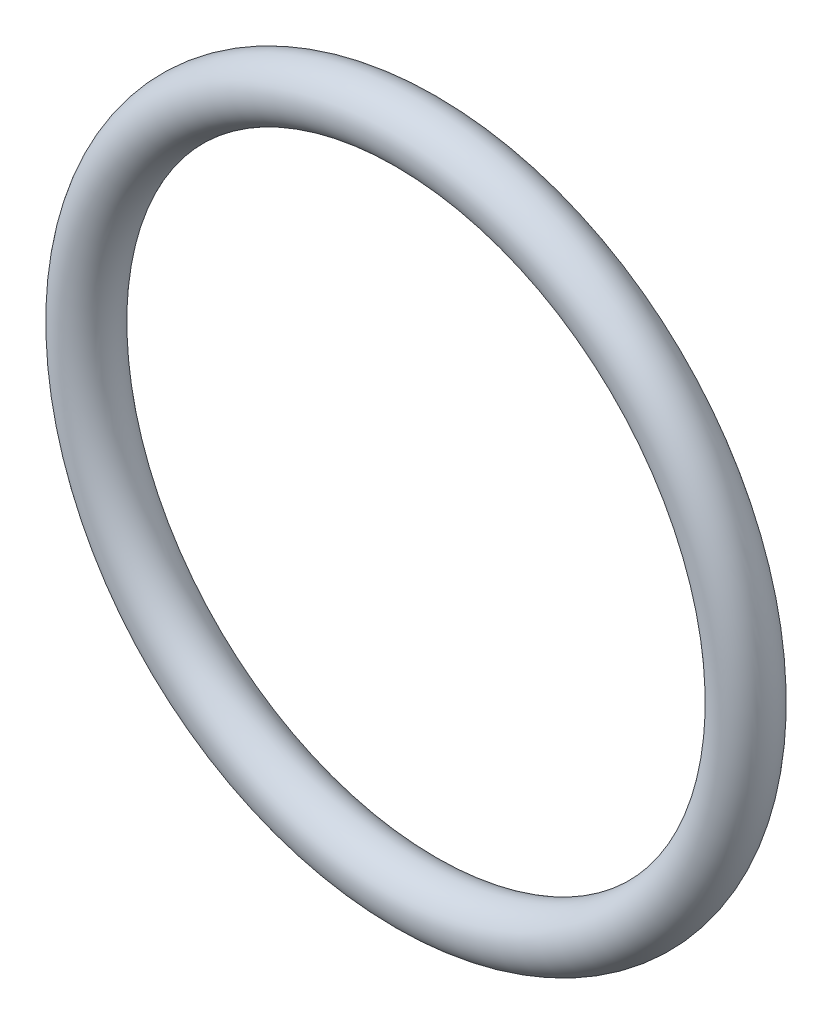
ISO-10303-21;
HEADER;
FILE_DESCRIPTION(('STEP AP214'),'2;1');
FILE_NAME('part.step','',(''),(''),'','','');
FILE_SCHEMA(('AUTOMOTIVE_DESIGN { 1 0 10303 214 1 1 1 1 }'));
ENDSEC;
DATA;
#1=APPLICATION_CONTEXT('core data for automotive mechanical design processes');
#2=APPLICATION_PROTOCOL_DEFINITION('international standard','automotive_design',2000,#1);
#3=PRODUCT_CONTEXT('',#1,'mechanical');
#4=PRODUCT('Part','Part','',(#3));
#5=PRODUCT_RELATED_PRODUCT_CATEGORY('part','',(#4));
#6=PRODUCT_DEFINITION_FORMATION('','',#4);
#7=PRODUCT_DEFINITION_CONTEXT('part definition',#1,'design');
#8=PRODUCT_DEFINITION('design','',#6,#7);
#9=PRODUCT_DEFINITION_SHAPE('','',#8);
#10=(LENGTH_UNIT() NAMED_UNIT(*) SI_UNIT(.MILLI.,.METRE.));
#11=(NAMED_UNIT(*) PLANE_ANGLE_UNIT() SI_UNIT($,.RADIAN.));
#12=(NAMED_UNIT(*) SI_UNIT($,.STERADIAN.) SOLID_ANGLE_UNIT());
#13=UNCERTAINTY_MEASURE_WITH_UNIT(LENGTH_MEASURE(1.E-05),#10,'distance_accuracy_value','');
#14=(GEOMETRIC_REPRESENTATION_CONTEXT(3) GLOBAL_UNCERTAINTY_ASSIGNED_CONTEXT((#13)) GLOBAL_UNIT_ASSIGNED_CONTEXT((#10,
#11,#12)) REPRESENTATION_CONTEXT('',''));
#15=CARTESIAN_POINT('',(0.,0.,0.));
#16=DIRECTION('',(0.,0.,1.));
#17=DIRECTION('',(1.,0.,0.));
#18=AXIS2_PLACEMENT_3D('',#15,#16,#17);
#19=CARTESIAN_POINT('',(0.,0.,0.));
#20=DIRECTION('',(0.,0.,1.));
#21=DIRECTION('',(1.,0.,0.));
#22=AXIS2_PLACEMENT_3D('',#19,#20,#21);
#23=TOROIDAL_SURFACE('',#22,23.0016375097351,2.);
#24=CARTESIAN_POINT('',(0.,23.0016375097351,0.));
#25=DIRECTION('',(1.,0.,0.));
#26=DIRECTION('',(0.,0.,-1.));
#27=AXIS2_PLACEMENT_3D('',#24,#25,#26);
#28=CIRCLE('',#27,2.);
#29=CARTESIAN_POINT('',(0.,25.0016375097351,0.));
#30=VERTEX_POINT('',#29);
#31=EDGE_CURVE('E10',#30,#30,#28,.T.);
#32=CARTESIAN_POINT('',(0.,0.,0.));
#33=DIRECTION('',(0.,0.,1.));
#34=DIRECTION('',(1.,0.,0.));
#35=AXIS2_PLACEMENT_3D('',#32,#33,#34);
#36=CIRCLE('',#35,25.0016375097351);
#37=EDGE_CURVE('',#30,#30,#36,.T.);
#38=ORIENTED_EDGE('',*,*,#31,.F.);
#39=ORIENTED_EDGE('',*,*,#31,.T.);
#40=ORIENTED_EDGE('',*,*,#37,.T.);
#41=ORIENTED_EDGE('',*,*,#37,.F.);
#42=EDGE_LOOP('',(#38,#40,#39,#41));
#43=FACE_BOUND('',#42,.T.);
#44=ADVANCED_FACE('F37',(#43),#23,.T.);
#45=CLOSED_SHELL('',(#44));
#46=MANIFOLD_SOLID_BREP('B2',#45);
#47=ADVANCED_BREP_SHAPE_REPRESENTATION('',(#18,#46),#14);
#48=SHAPE_DEFINITION_REPRESENTATION(#9,#47);
ENDSEC;
END-ISO-10303-21;
